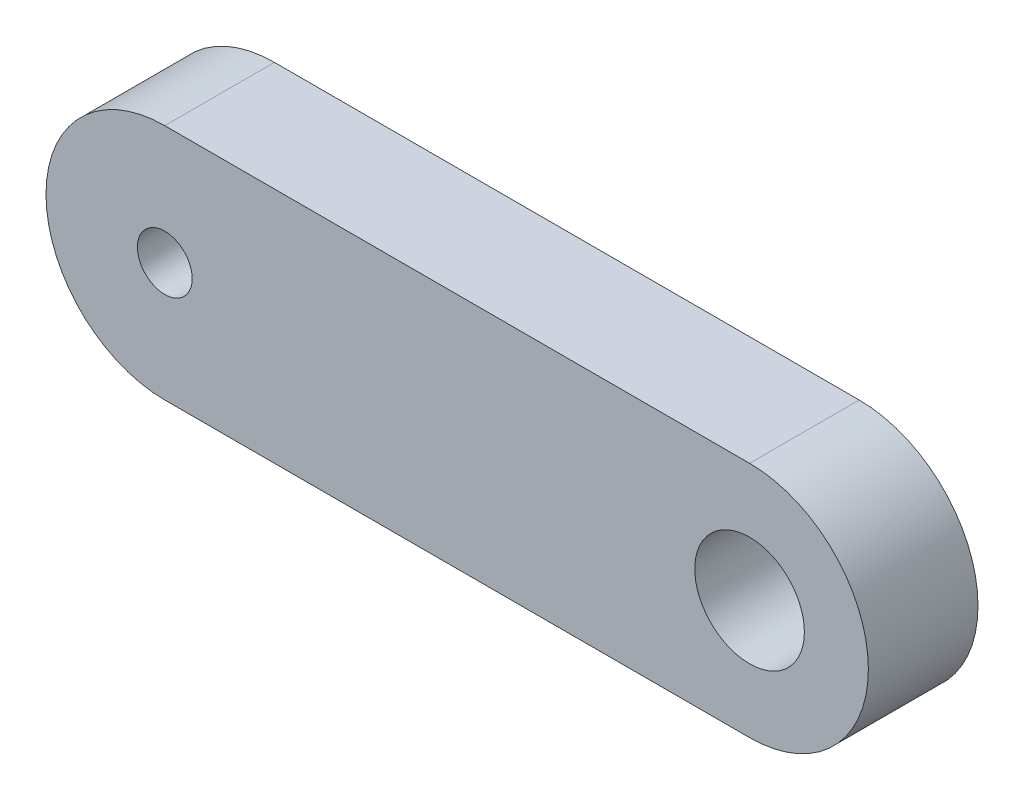
ISO-10303-21;
HEADER;
FILE_DESCRIPTION(('STEP AP214'),'2;1');
FILE_NAME('part.step','',(''),(''),'','','');
FILE_SCHEMA(('AUTOMOTIVE_DESIGN { 1 0 10303 214 1 1 1 1 }'));
ENDSEC;
DATA;
#1=APPLICATION_CONTEXT('core data for automotive mechanical design processes');
#2=APPLICATION_PROTOCOL_DEFINITION('international standard','automotive_design',2000,#1);
#3=PRODUCT_CONTEXT('',#1,'mechanical');
#4=PRODUCT('Part','Part','',(#3));
#5=PRODUCT_RELATED_PRODUCT_CATEGORY('part','',(#4));
#6=PRODUCT_DEFINITION_FORMATION('','',#4);
#7=PRODUCT_DEFINITION_CONTEXT('part definition',#1,'design');
#8=PRODUCT_DEFINITION('design','',#6,#7);
#9=PRODUCT_DEFINITION_SHAPE('','',#8);
#10=(LENGTH_UNIT() NAMED_UNIT(*) SI_UNIT(.MILLI.,.METRE.));
#11=(NAMED_UNIT(*) PLANE_ANGLE_UNIT() SI_UNIT($,.RADIAN.));
#12=(NAMED_UNIT(*) SI_UNIT($,.STERADIAN.) SOLID_ANGLE_UNIT());
#13=UNCERTAINTY_MEASURE_WITH_UNIT(LENGTH_MEASURE(1.E-05),#10,'distance_accuracy_value','');
#14=(GEOMETRIC_REPRESENTATION_CONTEXT(3) GLOBAL_UNCERTAINTY_ASSIGNED_CONTEXT((#13)) GLOBAL_UNIT_ASSIGNED_CONTEXT((#10,
#11,#12)) REPRESENTATION_CONTEXT('',''));
#15=CARTESIAN_POINT('',(0.,0.,0.));
#16=DIRECTION('',(0.,0.,1.));
#17=DIRECTION('',(1.,0.,0.));
#18=AXIS2_PLACEMENT_3D('',#15,#16,#17);
#19=CARTESIAN_POINT('',(-8.,0.,1.5));
#20=DIRECTION('',(0.,0.,1.));
#21=DIRECTION('',(1.,0.,0.));
#22=AXIS2_PLACEMENT_3D('',#19,#20,#21);
#23=PLANE('',#22);
#24=CARTESIAN_POINT('',(-8.,0.,1.5));
#25=DIRECTION('',(0.,0.,1.));
#26=DIRECTION('',(1.,0.,0.));
#27=AXIS2_PLACEMENT_3D('',#24,#25,#26);
#28=CIRCLE('',#27,0.75);
#29=CARTESIAN_POINT('',(-7.25,0.,1.5));
#30=VERTEX_POINT('',#29);
#31=EDGE_CURVE('E100',#30,#30,#28,.T.);
#32=ORIENTED_EDGE('',*,*,#31,.F.);
#33=EDGE_LOOP('',(#32));
#34=FACE_BOUND('',#33,.T.);
#35=CARTESIAN_POINT('',(-8.,0.,1.5));
#36=DIRECTION('',(0.,0.,1.));
#37=DIRECTION('',(1.,0.,0.));
#38=AXIS2_PLACEMENT_3D('',#35,#36,#37);
#39=CIRCLE('',#38,3.25);
#40=CARTESIAN_POINT('',(-8.,3.25,1.5));
#41=VERTEX_POINT('',#40);
#42=CARTESIAN_POINT('',(-8.,-3.25,1.5));
#43=VERTEX_POINT('',#42);
#44=EDGE_CURVE('E85',#41,#43,#39,.T.);
#45=ORIENTED_EDGE('',*,*,#44,.T.);
#46=DIRECTION('',(1.,0.,0.));
#47=VECTOR('',#46,1.);
#48=CARTESIAN_POINT('',(-8.,-3.25,1.5));
#49=LINE('',#48,#47);
#50=CARTESIAN_POINT('',(8.,-3.25,1.5));
#51=VERTEX_POINT('',#50);
#52=EDGE_CURVE('E80',#43,#51,#49,.T.);
#53=ORIENTED_EDGE('',*,*,#52,.T.);
#54=CARTESIAN_POINT('',(8.,0.,1.5));
#55=DIRECTION('',(0.,0.,1.));
#56=DIRECTION('',(1.,0.,0.));
#57=AXIS2_PLACEMENT_3D('',#54,#55,#56);
#58=CIRCLE('',#57,3.25);
#59=CARTESIAN_POINT('',(8.,3.25,1.5));
#60=VERTEX_POINT('',#59);
#61=EDGE_CURVE('E83',#51,#60,#58,.T.);
#62=ORIENTED_EDGE('',*,*,#61,.T.);
#63=DIRECTION('',(-1.,0.,0.));
#64=VECTOR('',#63,1.);
#65=CARTESIAN_POINT('',(-8.,3.25,1.5));
#66=LINE('',#65,#64);
#67=EDGE_CURVE('E50',#60,#41,#66,.T.);
#68=ORIENTED_EDGE('',*,*,#67,.T.);
#69=EDGE_LOOP('',(#45,#53,#62,#68));
#70=FACE_BOUND('',#69,.T.);
#71=CARTESIAN_POINT('',(8.,0.,1.5));
#72=DIRECTION('',(0.,0.,1.));
#73=DIRECTION('',(1.,0.,0.));
#74=AXIS2_PLACEMENT_3D('',#71,#72,#73);
#75=CIRCLE('',#74,1.5);
#76=CARTESIAN_POINT('',(9.5,0.,1.5));
#77=VERTEX_POINT('',#76);
#78=EDGE_CURVE('E115',#77,#77,#75,.T.);
#79=ORIENTED_EDGE('',*,*,#78,.F.);
#80=EDGE_LOOP('',(#79));
#81=FACE_BOUND('',#80,.T.);
#82=ADVANCED_FACE('F33',(#34,#70,#81),#23,.T.);
#83=CARTESIAN_POINT('',(-8.,0.,-1.5));
#84=DIRECTION('',(0.,0.,1.));
#85=DIRECTION('',(1.,0.,0.));
#86=AXIS2_PLACEMENT_3D('',#83,#84,#85);
#87=PLANE('',#86);
#88=CARTESIAN_POINT('',(-8.,0.,-1.5));
#89=DIRECTION('',(0.,0.,1.));
#90=DIRECTION('',(1.,0.,0.));
#91=AXIS2_PLACEMENT_3D('',#88,#89,#90);
#92=CIRCLE('',#91,3.25);
#93=CARTESIAN_POINT('',(-8.,3.25,-1.5));
#94=VERTEX_POINT('',#93);
#95=CARTESIAN_POINT('',(-8.,-3.25,-1.5));
#96=VERTEX_POINT('',#95);
#97=EDGE_CURVE('E97',#94,#96,#92,.T.);
#98=ORIENTED_EDGE('',*,*,#97,.F.);
#99=DIRECTION('',(-1.,0.,0.));
#100=VECTOR('',#99,1.);
#101=CARTESIAN_POINT('',(-8.,3.25,-1.5));
#102=LINE('',#101,#100);
#103=CARTESIAN_POINT('',(8.,3.25,-1.5));
#104=VERTEX_POINT('',#103);
#105=EDGE_CURVE('E73',#104,#94,#102,.T.);
#106=ORIENTED_EDGE('',*,*,#105,.F.);
#107=CARTESIAN_POINT('',(8.,0.,-1.5));
#108=DIRECTION('',(0.,0.,1.));
#109=DIRECTION('',(1.,0.,0.));
#110=AXIS2_PLACEMENT_3D('',#107,#108,#109);
#111=CIRCLE('',#110,3.25);
#112=CARTESIAN_POINT('',(8.,-3.25,-1.5));
#113=VERTEX_POINT('',#112);
#114=EDGE_CURVE('E67',#113,#104,#111,.T.);
#115=ORIENTED_EDGE('',*,*,#114,.F.);
#116=DIRECTION('',(1.,0.,0.));
#117=VECTOR('',#116,1.);
#118=CARTESIAN_POINT('',(-8.,-3.25,-1.5));
#119=LINE('',#118,#117);
#120=EDGE_CURVE('E89',#96,#113,#119,.T.);
#121=ORIENTED_EDGE('',*,*,#120,.F.);
#122=EDGE_LOOP('',(#98,#106,#115,#121));
#123=FACE_BOUND('',#122,.T.);
#124=CARTESIAN_POINT('',(-8.,0.,-1.5));
#125=DIRECTION('',(0.,0.,1.));
#126=DIRECTION('',(1.,0.,0.));
#127=AXIS2_PLACEMENT_3D('',#124,#125,#126);
#128=CIRCLE('',#127,0.75);
#129=CARTESIAN_POINT('',(-7.25,0.,-1.5));
#130=VERTEX_POINT('',#129);
#131=EDGE_CURVE('E112',#130,#130,#128,.T.);
#132=ORIENTED_EDGE('',*,*,#131,.T.);
#133=EDGE_LOOP('',(#132));
#134=FACE_BOUND('',#133,.T.);
#135=CARTESIAN_POINT('',(8.,0.,-1.5));
#136=DIRECTION('',(0.,0.,1.));
#137=DIRECTION('',(1.,0.,0.));
#138=AXIS2_PLACEMENT_3D('',#135,#136,#137);
#139=CIRCLE('',#138,1.5);
#140=CARTESIAN_POINT('',(9.5,0.,-1.5));
#141=VERTEX_POINT('',#140);
#142=EDGE_CURVE('E118',#141,#141,#139,.T.);
#143=ORIENTED_EDGE('',*,*,#142,.T.);
#144=EDGE_LOOP('',(#143));
#145=FACE_BOUND('',#144,.T.);
#146=ADVANCED_FACE('F108',(#123,#134,#145),#87,.F.);
#147=CARTESIAN_POINT('',(-8.,0.,1.5));
#148=DIRECTION('',(0.,0.,-1.));
#149=DIRECTION('',(-1.,0.,0.));
#150=AXIS2_PLACEMENT_3D('',#147,#148,#149);
#151=CYLINDRICAL_SURFACE('',#150,3.25);
#152=ORIENTED_EDGE('',*,*,#97,.T.);
#153=DIRECTION('',(0.,0.,-1.));
#154=VECTOR('',#153,1.);
#155=CARTESIAN_POINT('',(-8.,-3.25,1.5));
#156=LINE('',#155,#154);
#157=EDGE_CURVE('E11',#43,#96,#156,.T.);
#158=ORIENTED_EDGE('',*,*,#157,.F.);
#159=ORIENTED_EDGE('',*,*,#44,.F.);
#160=DIRECTION('',(0.,0.,-1.));
#161=VECTOR('',#160,1.);
#162=CARTESIAN_POINT('',(-8.,3.25,1.5));
#163=LINE('',#162,#161);
#164=EDGE_CURVE('E93',#41,#94,#163,.T.);
#165=ORIENTED_EDGE('',*,*,#164,.T.);
#166=EDGE_LOOP('',(#152,#158,#159,#165));
#167=FACE_BOUND('',#166,.T.);
#168=ADVANCED_FACE('F35',(#167),#151,.T.);
#169=CARTESIAN_POINT('',(-8.,-3.25,1.5));
#170=DIRECTION('',(0.,1.,0.));
#171=DIRECTION('',(-1.,0.,0.));
#172=AXIS2_PLACEMENT_3D('',#169,#170,#171);
#173=PLANE('',#172);
#174=ORIENTED_EDGE('',*,*,#120,.T.);
#175=DIRECTION('',(0.,0.,-1.));
#176=VECTOR('',#175,1.);
#177=CARTESIAN_POINT('',(8.,-3.25,1.5));
#178=LINE('',#177,#176);
#179=EDGE_CURVE('E42',#51,#113,#178,.T.);
#180=ORIENTED_EDGE('',*,*,#179,.F.);
#181=ORIENTED_EDGE('',*,*,#52,.F.);
#182=ORIENTED_EDGE('',*,*,#157,.T.);
#183=EDGE_LOOP('',(#174,#180,#181,#182));
#184=FACE_BOUND('',#183,.T.);
#185=ADVANCED_FACE('F88',(#184),#173,.F.);
#186=CARTESIAN_POINT('',(8.,0.,1.5));
#187=DIRECTION('',(0.,0.,-1.));
#188=DIRECTION('',(-1.,0.,0.));
#189=AXIS2_PLACEMENT_3D('',#186,#187,#188);
#190=CYLINDRICAL_SURFACE('',#189,3.25);
#191=ORIENTED_EDGE('',*,*,#114,.T.);
#192=DIRECTION('',(0.,0.,-1.));
#193=VECTOR('',#192,1.);
#194=CARTESIAN_POINT('',(8.,3.25,1.5));
#195=LINE('',#194,#193);
#196=EDGE_CURVE('E90',#60,#104,#195,.T.);
#197=ORIENTED_EDGE('',*,*,#196,.F.);
#198=ORIENTED_EDGE('',*,*,#61,.F.);
#199=ORIENTED_EDGE('',*,*,#179,.T.);
#200=EDGE_LOOP('',(#191,#197,#198,#199));
#201=FACE_BOUND('',#200,.T.);
#202=ADVANCED_FACE('F91',(#201),#190,.T.);
#203=CARTESIAN_POINT('',(-8.,3.25,1.5));
#204=DIRECTION('',(0.,-1.,0.));
#205=DIRECTION('',(1.,0.,0.));
#206=AXIS2_PLACEMENT_3D('',#203,#204,#205);
#207=PLANE('',#206);
#208=ORIENTED_EDGE('',*,*,#105,.T.);
#209=ORIENTED_EDGE('',*,*,#164,.F.);
#210=ORIENTED_EDGE('',*,*,#67,.F.);
#211=ORIENTED_EDGE('',*,*,#196,.T.);
#212=EDGE_LOOP('',(#208,#209,#210,#211));
#213=FACE_BOUND('',#212,.T.);
#214=ADVANCED_FACE('F105',(#213),#207,.F.);
#215=CARTESIAN_POINT('',(-8.,0.,1.5));
#216=DIRECTION('',(0.,0.,-1.));
#217=DIRECTION('',(-1.,0.,0.));
#218=AXIS2_PLACEMENT_3D('',#215,#216,#217);
#219=CYLINDRICAL_SURFACE('',#218,0.75);
#220=ORIENTED_EDGE('',*,*,#31,.T.);
#221=EDGE_LOOP('',(#220));
#222=FACE_BOUND('',#221,.T.);
#223=ORIENTED_EDGE('',*,*,#131,.F.);
#224=EDGE_LOOP('',(#223));
#225=FACE_BOUND('',#224,.T.);
#226=ADVANCED_FACE('F135',(#222,#225),#219,.F.);
#227=CARTESIAN_POINT('',(8.,0.,1.5));
#228=DIRECTION('',(0.,0.,-1.));
#229=DIRECTION('',(-1.,0.,0.));
#230=AXIS2_PLACEMENT_3D('',#227,#228,#229);
#231=CYLINDRICAL_SURFACE('',#230,1.5);
#232=ORIENTED_EDGE('',*,*,#78,.T.);
#233=EDGE_LOOP('',(#232));
#234=FACE_BOUND('',#233,.T.);
#235=ORIENTED_EDGE('',*,*,#142,.F.);
#236=EDGE_LOOP('',(#235));
#237=FACE_BOUND('',#236,.T.);
#238=ADVANCED_FACE('F124',(#234,#237),#231,.F.);
#239=CLOSED_SHELL('',(#82,#146,#168,#185,#202,#214,#226,#238));
#240=MANIFOLD_SOLID_BREP('B2',#239);
#241=ADVANCED_BREP_SHAPE_REPRESENTATION('',(#18,#240),#14);
#242=SHAPE_DEFINITION_REPRESENTATION(#9,#241);
ENDSEC;
END-ISO-10303-21;
